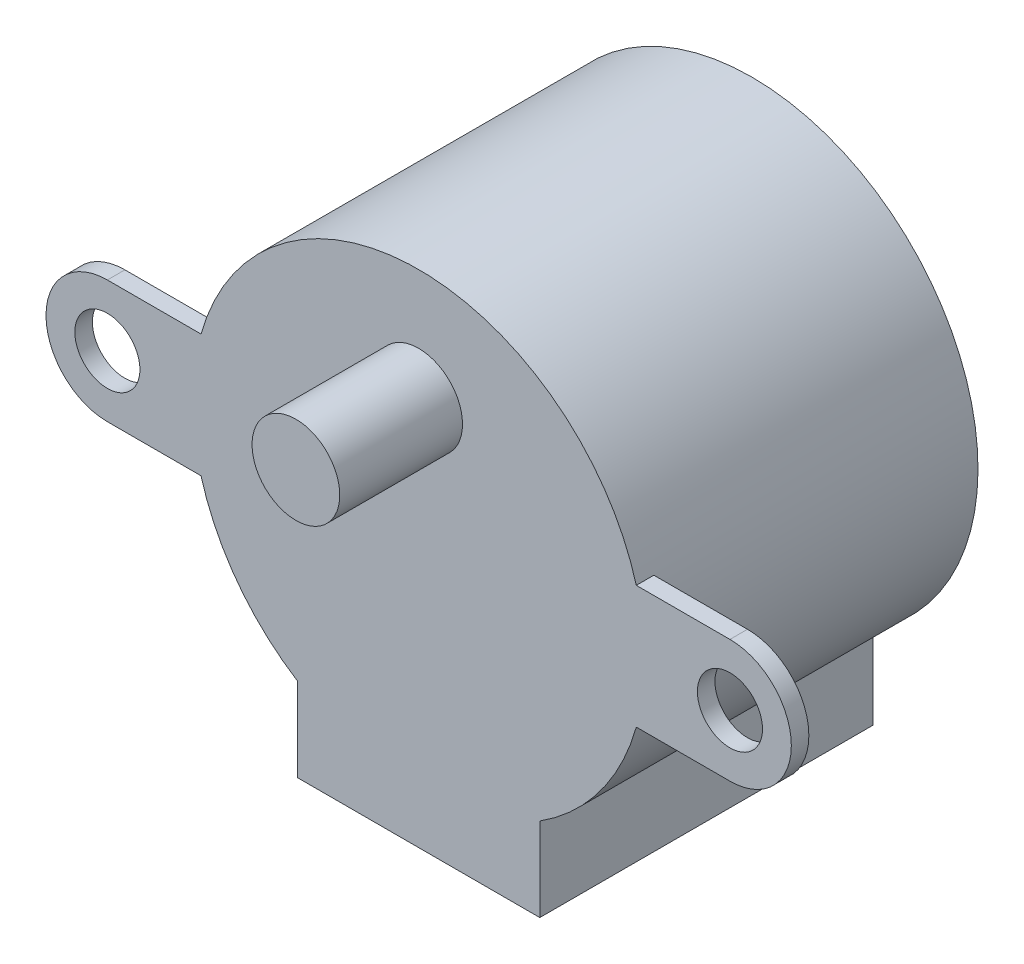
ISO-10303-21;
HEADER;
FILE_DESCRIPTION(('STEP AP214'),'2;1');
FILE_NAME('part.step','',(''),(''),'','','');
FILE_SCHEMA(('AUTOMOTIVE_DESIGN { 1 0 10303 214 1 1 1 1 }'));
ENDSEC;
DATA;
#1=APPLICATION_CONTEXT('core data for automotive mechanical design processes');
#2=APPLICATION_PROTOCOL_DEFINITION('international standard','automotive_design',2000,#1);
#3=PRODUCT_CONTEXT('',#1,'mechanical');
#4=PRODUCT('Part','Part','',(#3));
#5=PRODUCT_RELATED_PRODUCT_CATEGORY('part','',(#4));
#6=PRODUCT_DEFINITION_FORMATION('','',#4);
#7=PRODUCT_DEFINITION_CONTEXT('part definition',#1,'design');
#8=PRODUCT_DEFINITION('design','',#6,#7);
#9=PRODUCT_DEFINITION_SHAPE('','',#8);
#10=(LENGTH_UNIT() NAMED_UNIT(*) SI_UNIT(.MILLI.,.METRE.));
#11=(NAMED_UNIT(*) PLANE_ANGLE_UNIT() SI_UNIT($,.RADIAN.));
#12=(NAMED_UNIT(*) SI_UNIT($,.STERADIAN.) SOLID_ANGLE_UNIT());
#13=UNCERTAINTY_MEASURE_WITH_UNIT(LENGTH_MEASURE(1.E-05),#10,'distance_accuracy_value','');
#14=(GEOMETRIC_REPRESENTATION_CONTEXT(3) GLOBAL_UNCERTAINTY_ASSIGNED_CONTEXT((#13)) GLOBAL_UNIT_ASSIGNED_CONTEXT((#10,
#11,#12)) REPRESENTATION_CONTEXT('',''));
#15=CARTESIAN_POINT('',(0.,0.,0.));
#16=DIRECTION('',(0.,0.,1.));
#17=DIRECTION('',(1.,0.,0.));
#18=AXIS2_PLACEMENT_3D('',#15,#16,#17);
#19=CARTESIAN_POINT('',(17.75,0.,19.));
#20=DIRECTION('',(0.,0.,-1.));
#21=DIRECTION('',(-1.,0.,0.));
#22=AXIS2_PLACEMENT_3D('',#19,#20,#21);
#23=CYLINDRICAL_SURFACE('',#22,3.49999999999999);
#24=CARTESIAN_POINT('',(17.75,0.,18.));
#25=DIRECTION('',(0.,0.,-1.));
#26=DIRECTION('',(-1.,0.,0.));
#27=AXIS2_PLACEMENT_3D('',#24,#25,#26);
#28=CIRCLE('',#27,3.49999999999999);
#29=CARTESIAN_POINT('',(17.75,3.49999999999999,18.));
#30=VERTEX_POINT('',#29);
#31=CARTESIAN_POINT('',(17.75,-3.49999999999999,18.));
#32=VERTEX_POINT('',#31);
#33=EDGE_CURVE('E49',#30,#32,#28,.T.);
#34=ORIENTED_EDGE('',*,*,#33,.F.);
#35=DIRECTION('',(0.,0.,-1.));
#36=VECTOR('',#35,1.);
#37=CARTESIAN_POINT('',(17.75,3.49999999999999,19.));
#38=LINE('',#37,#36);
#39=CARTESIAN_POINT('',(17.75,3.49999999999999,19.));
#40=VERTEX_POINT('',#39);
#41=EDGE_CURVE('E11',#40,#30,#38,.T.);
#42=ORIENTED_EDGE('',*,*,#41,.F.);
#43=CARTESIAN_POINT('',(17.75,0.,19.));
#44=DIRECTION('',(0.,0.,1.));
#45=DIRECTION('',(1.,0.,0.));
#46=AXIS2_PLACEMENT_3D('',#43,#44,#45);
#47=CIRCLE('',#46,3.49999999999999);
#48=CARTESIAN_POINT('',(17.75,-3.49999999999999,19.));
#49=VERTEX_POINT('',#48);
#50=EDGE_CURVE('E148',#49,#40,#47,.T.);
#51=ORIENTED_EDGE('',*,*,#50,.F.);
#52=DIRECTION('',(0.,0.,-1.));
#53=VECTOR('',#52,1.);
#54=CARTESIAN_POINT('',(17.75,-3.49999999999999,19.));
#55=LINE('',#54,#53);
#56=EDGE_CURVE('E135',#49,#32,#55,.T.);
#57=ORIENTED_EDGE('',*,*,#56,.T.);
#58=EDGE_LOOP('',(#34,#42,#51,#57));
#59=FACE_BOUND('',#58,.T.);
#60=ADVANCED_FACE('F33',(#59),#23,.T.);
#61=CARTESIAN_POINT('',(17.75,3.49999999999999,19.));
#62=DIRECTION('',(0.,-1.,0.));
#63=DIRECTION('',(0.,0.,-1.));
#64=AXIS2_PLACEMENT_3D('',#61,#62,#63);
#65=PLANE('',#64);
#66=DIRECTION('',(1.,0.,0.));
#67=VECTOR('',#66,1.);
#68=CARTESIAN_POINT('',(12.4106501935695,3.49999999999999,18.));
#69=LINE('',#68,#67);
#70=CARTESIAN_POINT('',(12.4106501935695,3.49999999999999,18.));
#71=VERTEX_POINT('',#70);
#72=EDGE_CURVE('E250',#71,#30,#69,.T.);
#73=ORIENTED_EDGE('',*,*,#72,.F.);
#74=DIRECTION('',(0.,0.,-1.));
#75=VECTOR('',#74,1.);
#76=CARTESIAN_POINT('',(12.4106501935695,3.49999999999999,19.));
#77=LINE('',#76,#75);
#78=CARTESIAN_POINT('',(12.4106501935695,3.49999999999999,19.));
#79=VERTEX_POINT('',#78);
#80=EDGE_CURVE('E41',#79,#71,#77,.T.);
#81=ORIENTED_EDGE('',*,*,#80,.F.);
#82=DIRECTION('',(-1.,0.,0.));
#83=VECTOR('',#82,1.);
#84=CARTESIAN_POINT('',(17.75,3.49999999999999,19.));
#85=LINE('',#84,#83);
#86=EDGE_CURVE('E87',#40,#79,#85,.T.);
#87=ORIENTED_EDGE('',*,*,#86,.F.);
#88=ORIENTED_EDGE('',*,*,#41,.T.);
#89=EDGE_LOOP('',(#73,#81,#87,#88));
#90=FACE_BOUND('',#89,.T.);
#91=ADVANCED_FACE('F249',(#90),#65,.F.);
#92=CARTESIAN_POINT('',(12.4106501935695,-3.49999999999999,19.));
#93=DIRECTION('',(0.,1.,0.));
#94=DIRECTION('',(0.,0.,1.));
#95=AXIS2_PLACEMENT_3D('',#92,#93,#94);
#96=PLANE('',#95);
#97=DIRECTION('',(-1.,0.,0.));
#98=VECTOR('',#97,1.);
#99=CARTESIAN_POINT('',(12.4106501935695,-3.5,18.));
#100=LINE('',#99,#98);
#101=CARTESIAN_POINT('',(12.4106501935695,-3.5,18.));
#102=VERTEX_POINT('',#101);
#103=EDGE_CURVE('E254',#32,#102,#100,.T.);
#104=ORIENTED_EDGE('',*,*,#103,.F.);
#105=ORIENTED_EDGE('',*,*,#56,.F.);
#106=DIRECTION('',(1.,0.,0.));
#107=VECTOR('',#106,1.);
#108=CARTESIAN_POINT('',(12.4106501935695,-3.49999999999999,19.));
#109=LINE('',#108,#107);
#110=CARTESIAN_POINT('',(12.4106501935695,-3.5,19.));
#111=VERTEX_POINT('',#110);
#112=EDGE_CURVE('E58',#111,#49,#109,.T.);
#113=ORIENTED_EDGE('',*,*,#112,.F.);
#114=DIRECTION('',(0.,0.,-1.));
#115=VECTOR('',#114,1.);
#116=CARTESIAN_POINT('',(12.4106501935695,-3.5,19.));
#117=LINE('',#116,#115);
#118=EDGE_CURVE('E129',#111,#102,#117,.T.);
#119=ORIENTED_EDGE('',*,*,#118,.T.);
#120=EDGE_LOOP('',(#104,#105,#113,#119));
#121=FACE_BOUND('',#120,.T.);
#122=ADVANCED_FACE('F285',(#121),#96,.F.);
#123=CARTESIAN_POINT('',(17.75,0.,19.));
#124=DIRECTION('',(0.,0.,-1.));
#125=DIRECTION('',(-1.,0.,0.));
#126=AXIS2_PLACEMENT_3D('',#123,#124,#125);
#127=CYLINDRICAL_SURFACE('',#126,1.85525586024592);
#128=CARTESIAN_POINT('',(17.75,0.,19.));
#129=DIRECTION('',(0.,0.,1.));
#130=DIRECTION('',(1.,0.,0.));
#131=AXIS2_PLACEMENT_3D('',#128,#129,#130);
#132=CIRCLE('',#131,1.85525586024592);
#133=CARTESIAN_POINT('',(19.6052558602459,0.,19.));
#134=VERTEX_POINT('',#133);
#135=EDGE_CURVE('E142',#134,#134,#132,.T.);
#136=ORIENTED_EDGE('',*,*,#135,.T.);
#137=EDGE_LOOP('',(#136));
#138=FACE_BOUND('',#137,.T.);
#139=CARTESIAN_POINT('',(17.75,0.,18.));
#140=DIRECTION('',(0.,0.,-1.));
#141=DIRECTION('',(-1.,0.,0.));
#142=AXIS2_PLACEMENT_3D('',#139,#140,#141);
#143=CIRCLE('',#142,1.85525586024592);
#144=CARTESIAN_POINT('',(15.8947441397541,0.,18.));
#145=VERTEX_POINT('',#144);
#146=EDGE_CURVE('E36',#145,#145,#143,.T.);
#147=ORIENTED_EDGE('',*,*,#146,.T.);
#148=EDGE_LOOP('',(#147));
#149=FACE_BOUND('',#148,.T.);
#150=ADVANCED_FACE('F265',(#138,#149),#127,.F.);
#151=CARTESIAN_POINT('',(-17.75,3.50000000000001,19.));
#152=DIRECTION('',(0.,-1.,0.));
#153=DIRECTION('',(1.,0.,0.));
#154=AXIS2_PLACEMENT_3D('',#151,#152,#153);
#155=PLANE('',#154);
#156=DIRECTION('',(1.,0.,0.));
#157=VECTOR('',#156,1.);
#158=CARTESIAN_POINT('',(-12.4106501935695,3.50000000000001,18.));
#159=LINE('',#158,#157);
#160=CARTESIAN_POINT('',(-17.75,3.5,18.));
#161=VERTEX_POINT('',#160);
#162=CARTESIAN_POINT('',(-12.4106501935695,3.50000000000001,18.));
#163=VERTEX_POINT('',#162);
#164=EDGE_CURVE('E175',#161,#163,#159,.T.);
#165=ORIENTED_EDGE('',*,*,#164,.F.);
#166=DIRECTION('',(0.,0.,-1.));
#167=VECTOR('',#166,1.);
#168=CARTESIAN_POINT('',(-17.75,3.50000000000001,19.));
#169=LINE('',#168,#167);
#170=CARTESIAN_POINT('',(-17.75,3.50000000000001,19.));
#171=VERTEX_POINT('',#170);
#172=EDGE_CURVE('E165',#171,#161,#169,.T.);
#173=ORIENTED_EDGE('',*,*,#172,.F.);
#174=DIRECTION('',(-1.,0.,0.));
#175=VECTOR('',#174,1.);
#176=CARTESIAN_POINT('',(-17.75,3.50000000000001,19.));
#177=LINE('',#176,#175);
#178=CARTESIAN_POINT('',(-12.4106501935695,3.50000000000001,19.));
#179=VERTEX_POINT('',#178);
#180=EDGE_CURVE('E202',#179,#171,#177,.T.);
#181=ORIENTED_EDGE('',*,*,#180,.F.);
#182=DIRECTION('',(0.,0.,-1.));
#183=VECTOR('',#182,1.);
#184=CARTESIAN_POINT('',(-12.4106501935695,3.50000000000001,19.));
#185=LINE('',#184,#183);
#186=EDGE_CURVE('E168',#179,#163,#185,.T.);
#187=ORIENTED_EDGE('',*,*,#186,.T.);
#188=EDGE_LOOP('',(#165,#173,#181,#187));
#189=FACE_BOUND('',#188,.T.);
#190=ADVANCED_FACE('F242',(#189),#155,.F.);
#191=CARTESIAN_POINT('',(-17.75,0.,19.));
#192=DIRECTION('',(0.,0.,-1.));
#193=DIRECTION('',(-1.,0.,0.));
#194=AXIS2_PLACEMENT_3D('',#191,#192,#193);
#195=CYLINDRICAL_SURFACE('',#194,3.5);
#196=CARTESIAN_POINT('',(-17.75,0.,18.));
#197=DIRECTION('',(0.,0.,-1.));
#198=DIRECTION('',(-1.,0.,0.));
#199=AXIS2_PLACEMENT_3D('',#196,#197,#198);
#200=CIRCLE('',#199,3.5);
#201=CARTESIAN_POINT('',(-17.75,-3.5,18.));
#202=VERTEX_POINT('',#201);
#203=EDGE_CURVE('E174',#202,#161,#200,.T.);
#204=ORIENTED_EDGE('',*,*,#203,.F.);
#205=DIRECTION('',(0.,0.,-1.));
#206=VECTOR('',#205,1.);
#207=CARTESIAN_POINT('',(-17.75,-3.5,19.));
#208=LINE('',#207,#206);
#209=CARTESIAN_POINT('',(-17.75,-3.5,19.));
#210=VERTEX_POINT('',#209);
#211=EDGE_CURVE('E162',#210,#202,#208,.T.);
#212=ORIENTED_EDGE('',*,*,#211,.F.);
#213=CARTESIAN_POINT('',(-17.75,0.,19.));
#214=DIRECTION('',(0.,0.,1.));
#215=DIRECTION('',(-1.,0.,0.));
#216=AXIS2_PLACEMENT_3D('',#213,#214,#215);
#217=CIRCLE('',#216,3.5);
#218=EDGE_CURVE('E204',#171,#210,#217,.T.);
#219=ORIENTED_EDGE('',*,*,#218,.F.);
#220=ORIENTED_EDGE('',*,*,#172,.T.);
#221=EDGE_LOOP('',(#204,#212,#219,#220));
#222=FACE_BOUND('',#221,.T.);
#223=ADVANCED_FACE('F237',(#222),#195,.T.);
#224=CARTESIAN_POINT('',(-12.4106501935695,-3.49999999999999,19.));
#225=DIRECTION('',(0.,1.,0.));
#226=DIRECTION('',(-1.,0.,0.));
#227=AXIS2_PLACEMENT_3D('',#224,#225,#226);
#228=PLANE('',#227);
#229=DIRECTION('',(-1.,0.,0.));
#230=VECTOR('',#229,1.);
#231=CARTESIAN_POINT('',(-12.4106501935695,-3.5,18.));
#232=LINE('',#231,#230);
#233=CARTESIAN_POINT('',(-12.4106501935695,-3.5,18.));
#234=VERTEX_POINT('',#233);
#235=EDGE_CURVE('E182',#234,#202,#232,.T.);
#236=ORIENTED_EDGE('',*,*,#235,.F.);
#237=DIRECTION('',(0.,0.,-1.));
#238=VECTOR('',#237,1.);
#239=CARTESIAN_POINT('',(-12.4106501935695,-3.49999999999999,19.));
#240=LINE('',#239,#238);
#241=CARTESIAN_POINT('',(-12.4106501935695,-3.49999999999999,19.));
#242=VERTEX_POINT('',#241);
#243=EDGE_CURVE('E159',#242,#234,#240,.T.);
#244=ORIENTED_EDGE('',*,*,#243,.F.);
#245=DIRECTION('',(1.,0.,0.));
#246=VECTOR('',#245,1.);
#247=CARTESIAN_POINT('',(-12.4106501935695,-3.49999999999999,19.));
#248=LINE('',#247,#246);
#249=EDGE_CURVE('E206',#210,#242,#248,.T.);
#250=ORIENTED_EDGE('',*,*,#249,.F.);
#251=ORIENTED_EDGE('',*,*,#211,.T.);
#252=EDGE_LOOP('',(#236,#244,#250,#251));
#253=FACE_BOUND('',#252,.T.);
#254=ADVANCED_FACE('F231',(#253),#228,.F.);
#255=CARTESIAN_POINT('',(-17.75,0.,19.));
#256=DIRECTION('',(0.,0.,-1.));
#257=DIRECTION('',(-1.,0.,0.));
#258=AXIS2_PLACEMENT_3D('',#255,#256,#257);
#259=CYLINDRICAL_SURFACE('',#258,1.85525586024592);
#260=CARTESIAN_POINT('',(-17.75,0.,19.));
#261=DIRECTION('',(0.,0.,1.));
#262=DIRECTION('',(-1.,0.,0.));
#263=AXIS2_PLACEMENT_3D('',#260,#261,#262);
#264=CIRCLE('',#263,1.85525586024592);
#265=CARTESIAN_POINT('',(-19.6052558602459,0.,19.));
#266=VERTEX_POINT('',#265);
#267=EDGE_CURVE('E179',#266,#266,#264,.T.);
#268=ORIENTED_EDGE('',*,*,#267,.T.);
#269=EDGE_LOOP('',(#268));
#270=FACE_BOUND('',#269,.T.);
#271=CARTESIAN_POINT('',(-17.75,0.,18.));
#272=DIRECTION('',(0.,0.,-1.));
#273=DIRECTION('',(-1.,0.,0.));
#274=AXIS2_PLACEMENT_3D('',#271,#272,#273);
#275=CIRCLE('',#274,1.85525586024592);
#276=CARTESIAN_POINT('',(-19.6052558602459,0.,18.));
#277=VERTEX_POINT('',#276);
#278=EDGE_CURVE('E172',#277,#277,#275,.T.);
#279=ORIENTED_EDGE('',*,*,#278,.T.);
#280=EDGE_LOOP('',(#279));
#281=FACE_BOUND('',#280,.T.);
#282=ADVANCED_FACE('F309',(#270,#281),#259,.F.);
#283=CARTESIAN_POINT('',(17.75,0.,19.));
#284=DIRECTION('',(0.,0.,1.));
#285=DIRECTION('',(1.,0.,0.));
#286=AXIS2_PLACEMENT_3D('',#283,#284,#285);
#287=PLANE('',#286);
#288=CARTESIAN_POINT('',(0.,6.5,19.));
#289=DIRECTION('',(0.,0.,1.));
#290=DIRECTION('',(1.,0.,0.));
#291=AXIS2_PLACEMENT_3D('',#288,#289,#290);
#292=CIRCLE('',#291,2.5);
#293=CARTESIAN_POINT('',(2.5,6.5,19.));
#294=VERTEX_POINT('',#293);
#295=EDGE_CURVE('E388',#294,#294,#292,.T.);
#296=ORIENTED_EDGE('',*,*,#295,.F.);
#297=EDGE_LOOP('',(#296));
#298=FACE_BOUND('',#297,.T.);
#299=ORIENTED_EDGE('',*,*,#135,.F.);
#300=EDGE_LOOP('',(#299));
#301=FACE_BOUND('',#300,.T.);
#302=ORIENTED_EDGE('',*,*,#50,.T.);
#303=ORIENTED_EDGE('',*,*,#86,.T.);
#304=CARTESIAN_POINT('',(0.,0.,19.));
#305=DIRECTION('',(0.,0.,1.));
#306=DIRECTION('',(1.,0.,0.));
#307=AXIS2_PLACEMENT_3D('',#304,#305,#306);
#308=CIRCLE('',#307,12.8947368421053);
#309=EDGE_CURVE('E200',#79,#179,#308,.T.);
#310=ORIENTED_EDGE('',*,*,#309,.T.);
#311=ORIENTED_EDGE('',*,*,#180,.T.);
#312=ORIENTED_EDGE('',*,*,#218,.T.);
#313=ORIENTED_EDGE('',*,*,#249,.T.);
#314=CARTESIAN_POINT('',(0.,0.,19.));
#315=DIRECTION('',(0.,0.,1.));
#316=DIRECTION('',(1.,0.,0.));
#317=AXIS2_PLACEMENT_3D('',#314,#315,#316);
#318=CIRCLE('',#317,12.8947368421053);
#319=CARTESIAN_POINT('',(-6.90789473684212,-10.8883069635208,19.));
#320=VERTEX_POINT('',#319);
#321=EDGE_CURVE('E208',#242,#320,#318,.T.);
#322=ORIENTED_EDGE('',*,*,#321,.T.);
#323=DIRECTION('',(0.,-1.,0.));
#324=VECTOR('',#323,1.);
#325=CARTESIAN_POINT('',(-6.90789473684211,-12.8947368421053,19.));
#326=LINE('',#325,#324);
#327=CARTESIAN_POINT('',(-6.90789473684211,-15.6578947368421,19.));
#328=VERTEX_POINT('',#327);
#329=EDGE_CURVE('E210',#320,#328,#326,.T.);
#330=ORIENTED_EDGE('',*,*,#329,.T.);
#331=DIRECTION('',(1.,0.,0.));
#332=VECTOR('',#331,1.);
#333=CARTESIAN_POINT('',(6.90789473684211,-15.6578947368421,19.));
#334=LINE('',#333,#332);
#335=CARTESIAN_POINT('',(6.90789473684211,-15.6578947368421,19.));
#336=VERTEX_POINT('',#335);
#337=EDGE_CURVE('E121',#328,#336,#334,.T.);
#338=ORIENTED_EDGE('',*,*,#337,.T.);
#339=DIRECTION('',(0.,1.,0.));
#340=VECTOR('',#339,1.);
#341=CARTESIAN_POINT('',(6.90789473684211,-12.8947368421053,19.));
#342=LINE('',#341,#340);
#343=CARTESIAN_POINT('',(6.90789473684211,-10.8883069635208,19.));
#344=VERTEX_POINT('',#343);
#345=EDGE_CURVE('E114',#336,#344,#342,.T.);
#346=ORIENTED_EDGE('',*,*,#345,.T.);
#347=CARTESIAN_POINT('',(0.,0.,19.));
#348=DIRECTION('',(0.,0.,1.));
#349=DIRECTION('',(1.,0.,0.));
#350=AXIS2_PLACEMENT_3D('',#347,#348,#349);
#351=CIRCLE('',#350,12.8947368421053);
#352=EDGE_CURVE('E118',#344,#111,#351,.T.);
#353=ORIENTED_EDGE('',*,*,#352,.T.);
#354=ORIENTED_EDGE('',*,*,#112,.T.);
#355=EDGE_LOOP('',(#302,#303,#310,#311,#312,#313,#322,#330,#338,#346,#353,#354));
#356=FACE_BOUND('',#355,.T.);
#357=ORIENTED_EDGE('',*,*,#267,.F.);
#358=EDGE_LOOP('',(#357));
#359=FACE_BOUND('',#358,.T.);
#360=ADVANCED_FACE('F115',(#298,#301,#356,#359),#287,.T.);
#361=CARTESIAN_POINT('',(17.75,0.,0.));
#362=DIRECTION('',(0.,0.,1.));
#363=DIRECTION('',(1.,0.,0.));
#364=AXIS2_PLACEMENT_3D('',#361,#362,#363);
#365=PLANE('',#364);
#366=DIRECTION('',(0.,-1.,0.));
#367=VECTOR('',#366,1.);
#368=CARTESIAN_POINT('',(-6.90789473684211,-12.8947368421053,0.));
#369=LINE('',#368,#367);
#370=CARTESIAN_POINT('',(-6.90789473684212,-10.8883069635208,0.));
#371=VERTEX_POINT('',#370);
#372=CARTESIAN_POINT('',(-6.90789473684211,-15.6578947368421,0.));
#373=VERTEX_POINT('',#372);
#374=EDGE_CURVE('E139',#371,#373,#369,.T.);
#375=ORIENTED_EDGE('',*,*,#374,.F.);
#376=CARTESIAN_POINT('',(0.,0.,0.));
#377=DIRECTION('',(0.,0.,1.));
#378=DIRECTION('',(1.,0.,0.));
#379=AXIS2_PLACEMENT_3D('',#376,#377,#378);
#380=CIRCLE('',#379,12.8947368421053);
#381=CARTESIAN_POINT('',(6.90789473684211,-10.8883069635208,0.));
#382=VERTEX_POINT('',#381);
#383=EDGE_CURVE('E146',#382,#371,#380,.T.);
#384=ORIENTED_EDGE('',*,*,#383,.F.);
#385=DIRECTION('',(0.,1.,0.));
#386=VECTOR('',#385,1.);
#387=CARTESIAN_POINT('',(6.90789473684211,-12.8947368421053,0.));
#388=LINE('',#387,#386);
#389=CARTESIAN_POINT('',(6.90789473684211,-15.6578947368421,0.));
#390=VERTEX_POINT('',#389);
#391=EDGE_CURVE('E79',#390,#382,#388,.T.);
#392=ORIENTED_EDGE('',*,*,#391,.F.);
#393=DIRECTION('',(1.,0.,0.));
#394=VECTOR('',#393,1.);
#395=CARTESIAN_POINT('',(6.90789473684211,-15.6578947368421,0.));
#396=LINE('',#395,#394);
#397=EDGE_CURVE('E141',#373,#390,#396,.T.);
#398=ORIENTED_EDGE('',*,*,#397,.F.);
#399=EDGE_LOOP('',(#375,#384,#392,#398));
#400=FACE_BOUND('',#399,.T.);
#401=ADVANCED_FACE('F222',(#400),#365,.F.);
#402=CARTESIAN_POINT('',(-6.90789473684211,-12.8947368421053,19.));
#403=DIRECTION('',(1.,0.,0.));
#404=DIRECTION('',(0.,0.,-1.));
#405=AXIS2_PLACEMENT_3D('',#402,#403,#404);
#406=PLANE('',#405);
#407=ORIENTED_EDGE('',*,*,#374,.T.);
#408=DIRECTION('',(0.,0.,-1.));
#409=VECTOR('',#408,1.);
#410=CARTESIAN_POINT('',(-6.90789473684211,-15.6578947368421,19.));
#411=LINE('',#410,#409);
#412=EDGE_CURVE('E153',#328,#373,#411,.T.);
#413=ORIENTED_EDGE('',*,*,#412,.F.);
#414=ORIENTED_EDGE('',*,*,#329,.F.);
#415=DIRECTION('',(0.,0.,-1.));
#416=VECTOR('',#415,1.);
#417=CARTESIAN_POINT('',(-6.90789473684212,-10.8883069635208,19.));
#418=LINE('',#417,#416);
#419=EDGE_CURVE('E156',#320,#371,#418,.T.);
#420=ORIENTED_EDGE('',*,*,#419,.T.);
#421=EDGE_LOOP('',(#407,#413,#414,#420));
#422=FACE_BOUND('',#421,.T.);
#423=ADVANCED_FACE('F216',(#422),#406,.F.);
#424=CARTESIAN_POINT('',(6.90789473684211,-15.6578947368421,19.));
#425=DIRECTION('',(0.,1.,0.));
#426=DIRECTION('',(0.,0.,1.));
#427=AXIS2_PLACEMENT_3D('',#424,#425,#426);
#428=PLANE('',#427);
#429=ORIENTED_EDGE('',*,*,#397,.T.);
#430=DIRECTION('',(0.,0.,-1.));
#431=VECTOR('',#430,1.);
#432=CARTESIAN_POINT('',(6.90789473684211,-15.6578947368421,19.));
#433=LINE('',#432,#431);
#434=EDGE_CURVE('E128',#336,#390,#433,.T.);
#435=ORIENTED_EDGE('',*,*,#434,.F.);
#436=ORIENTED_EDGE('',*,*,#337,.F.);
#437=ORIENTED_EDGE('',*,*,#412,.T.);
#438=EDGE_LOOP('',(#429,#435,#436,#437));
#439=FACE_BOUND('',#438,.T.);
#440=ADVANCED_FACE('F220',(#439),#428,.F.);
#441=CARTESIAN_POINT('',(6.90789473684211,-12.8947368421053,19.));
#442=DIRECTION('',(-1.,0.,0.));
#443=DIRECTION('',(0.,0.,1.));
#444=AXIS2_PLACEMENT_3D('',#441,#442,#443);
#445=PLANE('',#444);
#446=ORIENTED_EDGE('',*,*,#391,.T.);
#447=DIRECTION('',(0.,0.,-1.));
#448=VECTOR('',#447,1.);
#449=CARTESIAN_POINT('',(6.90789473684211,-10.8883069635208,19.));
#450=LINE('',#449,#448);
#451=EDGE_CURVE('E124',#344,#382,#450,.T.);
#452=ORIENTED_EDGE('',*,*,#451,.F.);
#453=ORIENTED_EDGE('',*,*,#345,.F.);
#454=ORIENTED_EDGE('',*,*,#434,.T.);
#455=EDGE_LOOP('',(#446,#452,#453,#454));
#456=FACE_BOUND('',#455,.T.);
#457=ADVANCED_FACE('F125',(#456),#445,.F.);
#458=CARTESIAN_POINT('',(0.,0.,19.));
#459=DIRECTION('',(0.,0.,-1.));
#460=DIRECTION('',(-1.,0.,0.));
#461=AXIS2_PLACEMENT_3D('',#458,#459,#460);
#462=CYLINDRICAL_SURFACE('',#461,12.8947368421053);
#463=ORIENTED_EDGE('',*,*,#383,.T.);
#464=ORIENTED_EDGE('',*,*,#419,.F.);
#465=ORIENTED_EDGE('',*,*,#321,.F.);
#466=ORIENTED_EDGE('',*,*,#243,.T.);
#467=CARTESIAN_POINT('',(0.,0.,18.));
#468=DIRECTION('',(0.,0.,1.));
#469=DIRECTION('',(-1.,0.,0.));
#470=AXIS2_PLACEMENT_3D('',#467,#468,#469);
#471=CIRCLE('',#470,12.8947368421053);
#472=EDGE_CURVE('E190',#163,#234,#471,.T.);
#473=ORIENTED_EDGE('',*,*,#472,.F.);
#474=ORIENTED_EDGE('',*,*,#186,.F.);
#475=ORIENTED_EDGE('',*,*,#309,.F.);
#476=ORIENTED_EDGE('',*,*,#80,.T.);
#477=CARTESIAN_POINT('',(0.,0.,18.));
#478=DIRECTION('',(0.,0.,1.));
#479=DIRECTION('',(-1.,0.,0.));
#480=AXIS2_PLACEMENT_3D('',#477,#478,#479);
#481=CIRCLE('',#480,12.8947368421053);
#482=EDGE_CURVE('E255',#102,#71,#481,.T.);
#483=ORIENTED_EDGE('',*,*,#482,.F.);
#484=ORIENTED_EDGE('',*,*,#118,.F.);
#485=ORIENTED_EDGE('',*,*,#352,.F.);
#486=ORIENTED_EDGE('',*,*,#451,.T.);
#487=EDGE_LOOP('',(#463,#464,#465,#466,#473,#474,#475,#476,#483,#484,#485,#486));
#488=FACE_BOUND('',#487,.T.);
#489=ADVANCED_FACE('F131',(#488),#462,.T.);
#490=CARTESIAN_POINT('',(0.,0.,18.));
#491=DIRECTION('',(0.,0.,-1.));
#492=DIRECTION('',(-1.,0.,0.));
#493=AXIS2_PLACEMENT_3D('',#490,#491,#492);
#494=PLANE('',#493);
#495=ORIENTED_EDGE('',*,*,#278,.F.);
#496=EDGE_LOOP('',(#495));
#497=FACE_BOUND('',#496,.T.);
#498=ORIENTED_EDGE('',*,*,#203,.T.);
#499=ORIENTED_EDGE('',*,*,#164,.T.);
#500=ORIENTED_EDGE('',*,*,#472,.T.);
#501=ORIENTED_EDGE('',*,*,#235,.T.);
#502=EDGE_LOOP('',(#498,#499,#500,#501));
#503=FACE_BOUND('',#502,.T.);
#504=ADVANCED_FACE('F234',(#497,#503),#494,.T.);
#505=CARTESIAN_POINT('',(0.,0.,18.));
#506=DIRECTION('',(0.,0.,-1.));
#507=DIRECTION('',(-1.,0.,0.));
#508=AXIS2_PLACEMENT_3D('',#505,#506,#507);
#509=PLANE('',#508);
#510=ORIENTED_EDGE('',*,*,#146,.F.);
#511=EDGE_LOOP('',(#510));
#512=FACE_BOUND('',#511,.T.);
#513=ORIENTED_EDGE('',*,*,#33,.T.);
#514=ORIENTED_EDGE('',*,*,#103,.T.);
#515=ORIENTED_EDGE('',*,*,#482,.T.);
#516=ORIENTED_EDGE('',*,*,#72,.T.);
#517=EDGE_LOOP('',(#513,#514,#515,#516));
#518=FACE_BOUND('',#517,.T.);
#519=ADVANCED_FACE('F267',(#512,#518),#509,.T.);
#520=CARTESIAN_POINT('',(0.,6.5,26.));
#521=DIRECTION('',(0.,0.,-1.));
#522=DIRECTION('',(-1.,0.,0.));
#523=AXIS2_PLACEMENT_3D('',#520,#521,#522);
#524=CYLINDRICAL_SURFACE('',#523,2.5);
#525=CARTESIAN_POINT('',(0.,6.5,26.));
#526=DIRECTION('',(0.,0.,1.));
#527=DIRECTION('',(1.,0.,0.));
#528=AXIS2_PLACEMENT_3D('',#525,#526,#527);
#529=CIRCLE('',#528,2.5);
#530=CARTESIAN_POINT('',(2.5,6.5,26.));
#531=VERTEX_POINT('',#530);
#532=EDGE_CURVE('E258',#531,#531,#529,.T.);
#533=ORIENTED_EDGE('',*,*,#532,.F.);
#534=EDGE_LOOP('',(#533));
#535=FACE_BOUND('',#534,.T.);
#536=ORIENTED_EDGE('',*,*,#295,.T.);
#537=EDGE_LOOP('',(#536));
#538=FACE_BOUND('',#537,.T.);
#539=ADVANCED_FACE('F269',(#535,#538),#524,.T.);
#540=CARTESIAN_POINT('',(0.,6.5,26.));
#541=DIRECTION('',(0.,0.,1.));
#542=DIRECTION('',(1.,0.,0.));
#543=AXIS2_PLACEMENT_3D('',#540,#541,#542);
#544=PLANE('',#543);
#545=ORIENTED_EDGE('',*,*,#532,.T.);
#546=EDGE_LOOP('',(#545));
#547=FACE_BOUND('',#546,.T.);
#548=ADVANCED_FACE('F275',(#547),#544,.T.);
#549=CLOSED_SHELL('',(#60,#91,#122,#150,#190,#223,#254,#282,#360,#401,#423,#440,#457,#489,#504,
#519,#539,#548));
#550=MANIFOLD_SOLID_BREP('B2',#549);
#551=ADVANCED_BREP_SHAPE_REPRESENTATION('',(#18,#550),#14);
#552=SHAPE_DEFINITION_REPRESENTATION(#9,#551);
ENDSEC;
END-ISO-10303-21;
